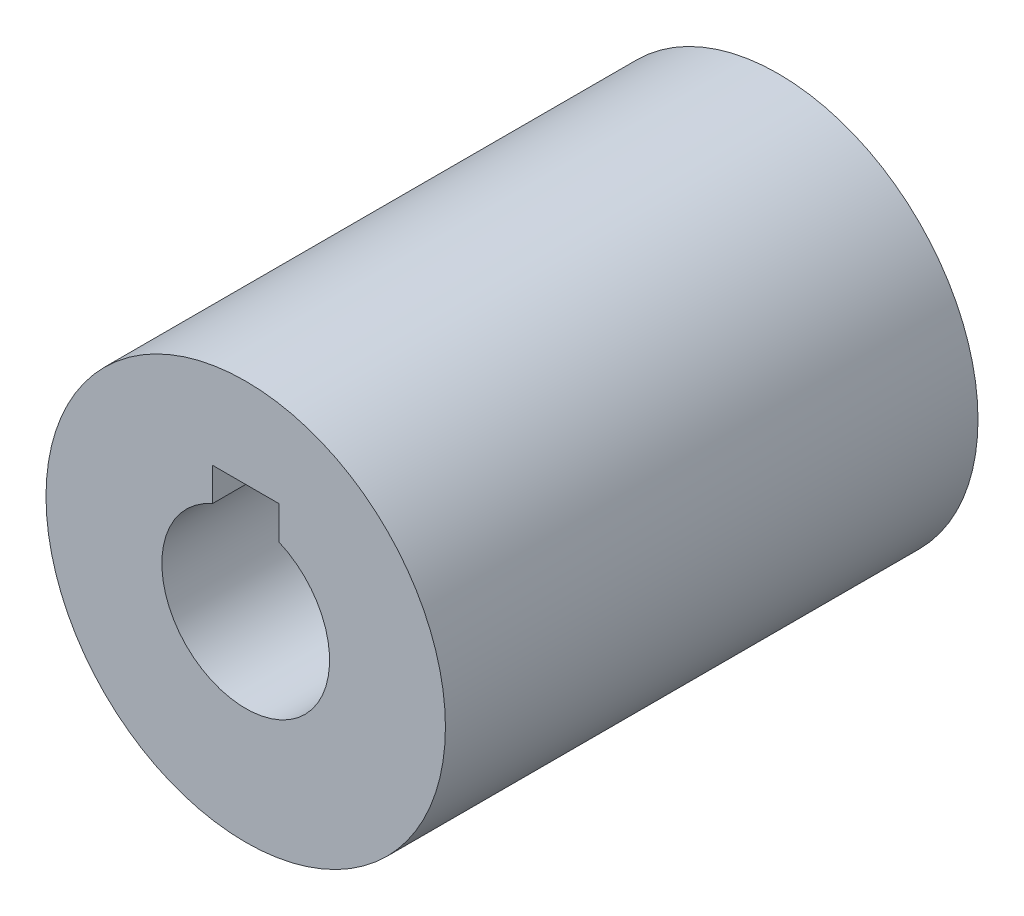
ISO-10303-21;
HEADER;
FILE_DESCRIPTION(('STEP AP214'),'2;1');
FILE_NAME('part.step','',(''),(''),'','','');
FILE_SCHEMA(('AUTOMOTIVE_DESIGN { 1 0 10303 214 1 1 1 1 }'));
ENDSEC;
DATA;
#1=APPLICATION_CONTEXT('core data for automotive mechanical design processes');
#2=APPLICATION_PROTOCOL_DEFINITION('international standard','automotive_design',2000,#1);
#3=PRODUCT_CONTEXT('',#1,'mechanical');
#4=PRODUCT('Part','Part','',(#3));
#5=PRODUCT_RELATED_PRODUCT_CATEGORY('part','',(#4));
#6=PRODUCT_DEFINITION_FORMATION('','',#4);
#7=PRODUCT_DEFINITION_CONTEXT('part definition',#1,'design');
#8=PRODUCT_DEFINITION('design','',#6,#7);
#9=PRODUCT_DEFINITION_SHAPE('','',#8);
#10=(LENGTH_UNIT() NAMED_UNIT(*) SI_UNIT(.MILLI.,.METRE.));
#11=(NAMED_UNIT(*) PLANE_ANGLE_UNIT() SI_UNIT($,.RADIAN.));
#12=(NAMED_UNIT(*) SI_UNIT($,.STERADIAN.) SOLID_ANGLE_UNIT());
#13=UNCERTAINTY_MEASURE_WITH_UNIT(LENGTH_MEASURE(1.E-05),#10,'distance_accuracy_value','');
#14=(GEOMETRIC_REPRESENTATION_CONTEXT(3) GLOBAL_UNCERTAINTY_ASSIGNED_CONTEXT((#13)) GLOBAL_UNIT_ASSIGNED_CONTEXT((#10,
#11,#12)) REPRESENTATION_CONTEXT('',''));
#15=CARTESIAN_POINT('',(0.,0.,0.));
#16=DIRECTION('',(0.,0.,1.));
#17=DIRECTION('',(1.,0.,0.));
#18=AXIS2_PLACEMENT_3D('',#15,#16,#17);
#19=CARTESIAN_POINT('',(0.,0.,25.4));
#20=DIRECTION('',(0.,0.,1.));
#21=DIRECTION('',(1.,0.,0.));
#22=AXIS2_PLACEMENT_3D('',#19,#20,#21);
#23=PLANE('',#22);
#24=DIRECTION('',(0.,-1.,0.));
#25=VECTOR('',#24,1.);
#26=CARTESIAN_POINT('',(-1.5875,5.25899067137586,25.4));
#27=LINE('',#26,#25);
#28=CARTESIAN_POINT('',(-1.5875,5.25899067137586,25.4));
#29=VERTEX_POINT('',#28);
#30=CARTESIAN_POINT('',(-1.5875,3.67149067137587,25.4));
#31=VERTEX_POINT('',#30);
#32=EDGE_CURVE('E80',#29,#31,#27,.T.);
#33=ORIENTED_EDGE('',*,*,#32,.F.);
#34=DIRECTION('',(-1.,0.,0.));
#35=VECTOR('',#34,1.);
#36=CARTESIAN_POINT('',(-1.5875,5.25899067137586,25.4));
#37=LINE('',#36,#35);
#38=CARTESIAN_POINT('',(1.5875,5.25899067137586,25.4));
#39=VERTEX_POINT('',#38);
#40=EDGE_CURVE('E92',#39,#29,#37,.T.);
#41=ORIENTED_EDGE('',*,*,#40,.F.);
#42=DIRECTION('',(0.,1.,0.));
#43=VECTOR('',#42,1.);
#44=CARTESIAN_POINT('',(1.5875,5.25899067137586,25.4));
#45=LINE('',#44,#43);
#46=CARTESIAN_POINT('',(1.5875,3.67149067137587,25.4));
#47=VERTEX_POINT('',#46);
#48=EDGE_CURVE('E104',#47,#39,#45,.T.);
#49=ORIENTED_EDGE('',*,*,#48,.F.);
#50=CARTESIAN_POINT('',(0.,0.,25.4));
#51=DIRECTION('',(0.,0.,1.));
#52=DIRECTION('',(1.,0.,0.));
#53=AXIS2_PLACEMENT_3D('',#50,#51,#52);
#54=CIRCLE('',#53,4.);
#55=EDGE_CURVE('E95',#31,#47,#54,.T.);
#56=ORIENTED_EDGE('',*,*,#55,.F.);
#57=EDGE_LOOP('',(#33,#41,#49,#56));
#58=FACE_BOUND('',#57,.T.);
#59=CARTESIAN_POINT('',(0.,0.,25.4));
#60=DIRECTION('',(0.,0.,1.));
#61=DIRECTION('',(1.,0.,0.));
#62=AXIS2_PLACEMENT_3D('',#59,#60,#61);
#63=CIRCLE('',#62,9.525);
#64=CARTESIAN_POINT('',(9.525,0.,25.4));
#65=VERTEX_POINT('',#64);
#66=EDGE_CURVE('E11',#65,#65,#63,.T.);
#67=ORIENTED_EDGE('',*,*,#66,.T.);
#68=EDGE_LOOP('',(#67));
#69=FACE_BOUND('',#68,.T.);
#70=ADVANCED_FACE('F33',(#58,#69),#23,.T.);
#71=CARTESIAN_POINT('',(0.,0.,0.));
#72=DIRECTION('',(0.,0.,1.));
#73=DIRECTION('',(1.,0.,0.));
#74=AXIS2_PLACEMENT_3D('',#71,#72,#73);
#75=PLANE('',#74);
#76=CARTESIAN_POINT('',(0.,0.,0.));
#77=DIRECTION('',(0.,0.,1.));
#78=DIRECTION('',(1.,0.,0.));
#79=AXIS2_PLACEMENT_3D('',#76,#77,#78);
#80=CIRCLE('',#79,9.525);
#81=CARTESIAN_POINT('',(9.525,0.,0.));
#82=VERTEX_POINT('',#81);
#83=EDGE_CURVE('E37',#82,#82,#80,.T.);
#84=ORIENTED_EDGE('',*,*,#83,.F.);
#85=EDGE_LOOP('',(#84));
#86=FACE_BOUND('',#85,.T.);
#87=DIRECTION('',(-1.,0.,0.));
#88=VECTOR('',#87,1.);
#89=CARTESIAN_POINT('',(-1.5875,5.25899067137586,0.));
#90=LINE('',#89,#88);
#91=CARTESIAN_POINT('',(1.5875,5.25899067137586,0.));
#92=VERTEX_POINT('',#91);
#93=CARTESIAN_POINT('',(-1.5875,5.25899067137586,0.));
#94=VERTEX_POINT('',#93);
#95=EDGE_CURVE('E86',#92,#94,#90,.T.);
#96=ORIENTED_EDGE('',*,*,#95,.T.);
#97=DIRECTION('',(0.,-1.,0.));
#98=VECTOR('',#97,1.);
#99=CARTESIAN_POINT('',(-1.5875,5.25899067137586,0.));
#100=LINE('',#99,#98);
#101=CARTESIAN_POINT('',(-1.5875,3.67149067137587,0.));
#102=VERTEX_POINT('',#101);
#103=EDGE_CURVE('E77',#94,#102,#100,.T.);
#104=ORIENTED_EDGE('',*,*,#103,.T.);
#105=CARTESIAN_POINT('',(0.,0.,0.));
#106=DIRECTION('',(0.,0.,1.));
#107=DIRECTION('',(1.,0.,0.));
#108=AXIS2_PLACEMENT_3D('',#105,#106,#107);
#109=CIRCLE('',#108,4.);
#110=CARTESIAN_POINT('',(1.5875,3.67149067137587,0.));
#111=VERTEX_POINT('',#110);
#112=EDGE_CURVE('E91',#102,#111,#109,.T.);
#113=ORIENTED_EDGE('',*,*,#112,.T.);
#114=DIRECTION('',(0.,1.,0.));
#115=VECTOR('',#114,1.);
#116=CARTESIAN_POINT('',(1.5875,5.25899067137586,0.));
#117=LINE('',#116,#115);
#118=EDGE_CURVE('E48',#111,#92,#117,.T.);
#119=ORIENTED_EDGE('',*,*,#118,.T.);
#120=EDGE_LOOP('',(#96,#104,#113,#119));
#121=FACE_BOUND('',#120,.T.);
#122=ADVANCED_FACE('F90',(#86,#121),#75,.F.);
#123=CARTESIAN_POINT('',(0.,0.,25.4));
#124=DIRECTION('',(0.,0.,-1.));
#125=DIRECTION('',(-1.,0.,0.));
#126=AXIS2_PLACEMENT_3D('',#123,#124,#125);
#127=CYLINDRICAL_SURFACE('',#126,9.525);
#128=ORIENTED_EDGE('',*,*,#66,.F.);
#129=EDGE_LOOP('',(#128));
#130=FACE_BOUND('',#129,.T.);
#131=ORIENTED_EDGE('',*,*,#83,.T.);
#132=EDGE_LOOP('',(#131));
#133=FACE_BOUND('',#132,.T.);
#134=ADVANCED_FACE('F35',(#130,#133),#127,.T.);
#135=CARTESIAN_POINT('',(0.,0.,25.4));
#136=DIRECTION('',(0.,0.,-1.));
#137=DIRECTION('',(-1.,0.,0.));
#138=AXIS2_PLACEMENT_3D('',#135,#136,#137);
#139=CYLINDRICAL_SURFACE('',#138,4.);
#140=DIRECTION('',(0.,0.,1.));
#141=VECTOR('',#140,1.);
#142=CARTESIAN_POINT('',(-1.5875,3.67149067137587,0.));
#143=LINE('',#142,#141);
#144=EDGE_CURVE('E74',#102,#31,#143,.T.);
#145=ORIENTED_EDGE('',*,*,#144,.T.);
#146=ORIENTED_EDGE('',*,*,#55,.T.);
#147=DIRECTION('',(0.,0.,1.));
#148=VECTOR('',#147,1.);
#149=CARTESIAN_POINT('',(1.5875,3.67149067137587,0.));
#150=LINE('',#149,#148);
#151=EDGE_CURVE('E85',#111,#47,#150,.T.);
#152=ORIENTED_EDGE('',*,*,#151,.F.);
#153=ORIENTED_EDGE('',*,*,#112,.F.);
#154=EDGE_LOOP('',(#145,#146,#152,#153));
#155=FACE_BOUND('',#154,.T.);
#156=ADVANCED_FACE('F94',(#155),#139,.F.);
#157=CARTESIAN_POINT('',(-1.5875,5.25899067137586,0.));
#158=DIRECTION('',(-1.,0.,0.));
#159=DIRECTION('',(0.,-1.,0.));
#160=AXIS2_PLACEMENT_3D('',#157,#158,#159);
#161=PLANE('',#160);
#162=ORIENTED_EDGE('',*,*,#32,.T.);
#163=ORIENTED_EDGE('',*,*,#144,.F.);
#164=ORIENTED_EDGE('',*,*,#103,.F.);
#165=DIRECTION('',(0.,0.,1.));
#166=VECTOR('',#165,1.);
#167=CARTESIAN_POINT('',(-1.5875,5.25899067137586,0.));
#168=LINE('',#167,#166);
#169=EDGE_CURVE('E57',#94,#29,#168,.T.);
#170=ORIENTED_EDGE('',*,*,#169,.T.);
#171=EDGE_LOOP('',(#162,#163,#164,#170));
#172=FACE_BOUND('',#171,.T.);
#173=ADVANCED_FACE('F76',(#172),#161,.F.);
#174=CARTESIAN_POINT('',(-1.5875,5.25899067137586,0.));
#175=DIRECTION('',(0.,1.,0.));
#176=DIRECTION('',(-1.,0.,0.));
#177=AXIS2_PLACEMENT_3D('',#174,#175,#176);
#178=PLANE('',#177);
#179=ORIENTED_EDGE('',*,*,#40,.T.);
#180=ORIENTED_EDGE('',*,*,#169,.F.);
#181=ORIENTED_EDGE('',*,*,#95,.F.);
#182=DIRECTION('',(0.,0.,1.));
#183=VECTOR('',#182,1.);
#184=CARTESIAN_POINT('',(1.5875,5.25899067137586,0.));
#185=LINE('',#184,#183);
#186=EDGE_CURVE('E98',#92,#39,#185,.T.);
#187=ORIENTED_EDGE('',*,*,#186,.T.);
#188=EDGE_LOOP('',(#179,#180,#181,#187));
#189=FACE_BOUND('',#188,.T.);
#190=ADVANCED_FACE('F114',(#189),#178,.F.);
#191=CARTESIAN_POINT('',(1.5875,5.25899067137586,0.));
#192=DIRECTION('',(1.,0.,0.));
#193=DIRECTION('',(0.,1.,0.));
#194=AXIS2_PLACEMENT_3D('',#191,#192,#193);
#195=PLANE('',#194);
#196=ORIENTED_EDGE('',*,*,#48,.T.);
#197=ORIENTED_EDGE('',*,*,#186,.F.);
#198=ORIENTED_EDGE('',*,*,#118,.F.);
#199=ORIENTED_EDGE('',*,*,#151,.T.);
#200=EDGE_LOOP('',(#196,#197,#198,#199));
#201=FACE_BOUND('',#200,.T.);
#202=ADVANCED_FACE('F111',(#201),#195,.F.);
#203=CLOSED_SHELL('',(#70,#122,#134,#156,#173,#190,#202));
#204=MANIFOLD_SOLID_BREP('B2',#203);
#205=ADVANCED_BREP_SHAPE_REPRESENTATION('',(#18,#204),#14);
#206=SHAPE_DEFINITION_REPRESENTATION(#9,#205);
ENDSEC;
END-ISO-10303-21;
